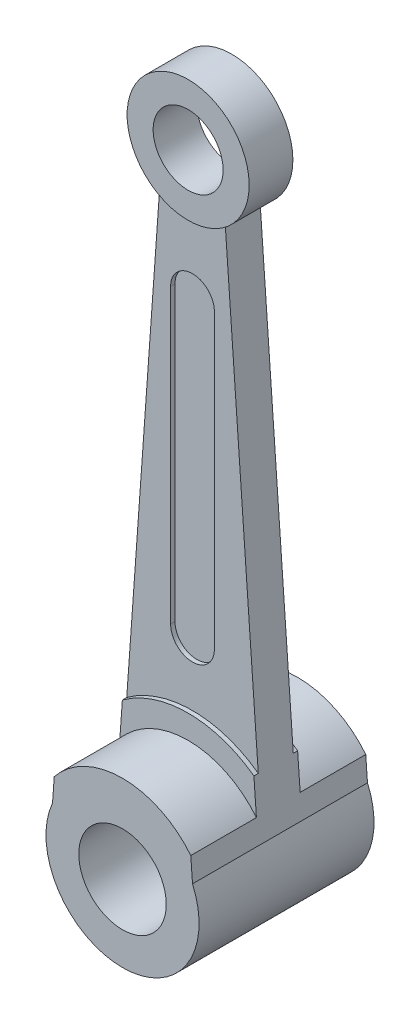
ISO-10303-21;
HEADER;
FILE_DESCRIPTION(('STEP AP214'),'2;1');
FILE_NAME('part.step','',(''),(''),'','','');
FILE_SCHEMA(('AUTOMOTIVE_DESIGN { 1 0 10303 214 1 1 1 1 }'));
ENDSEC;
DATA;
#1=APPLICATION_CONTEXT('core data for automotive mechanical design processes');
#2=APPLICATION_PROTOCOL_DEFINITION('international standard','automotive_design',2000,#1);
#3=PRODUCT_CONTEXT('',#1,'mechanical');
#4=PRODUCT('Part','Part','',(#3));
#5=PRODUCT_RELATED_PRODUCT_CATEGORY('part','',(#4));
#6=PRODUCT_DEFINITION_FORMATION('','',#4);
#7=PRODUCT_DEFINITION_CONTEXT('part definition',#1,'design');
#8=PRODUCT_DEFINITION('design','',#6,#7);
#9=PRODUCT_DEFINITION_SHAPE('','',#8);
#10=(LENGTH_UNIT() NAMED_UNIT(*) SI_UNIT(.MILLI.,.METRE.));
#11=(NAMED_UNIT(*) PLANE_ANGLE_UNIT() SI_UNIT($,.RADIAN.));
#12=(NAMED_UNIT(*) SI_UNIT($,.STERADIAN.) SOLID_ANGLE_UNIT());
#13=UNCERTAINTY_MEASURE_WITH_UNIT(LENGTH_MEASURE(1.E-05),#10,'distance_accuracy_value','');
#14=(GEOMETRIC_REPRESENTATION_CONTEXT(3) GLOBAL_UNCERTAINTY_ASSIGNED_CONTEXT((#13)) GLOBAL_UNIT_ASSIGNED_CONTEXT((#10,
#11,#12)) REPRESENTATION_CONTEXT('',''));
#15=CARTESIAN_POINT('',(0.,0.,0.));
#16=DIRECTION('',(0.,0.,1.));
#17=DIRECTION('',(1.,0.,0.));
#18=AXIS2_PLACEMENT_3D('',#15,#16,#17);
#19=CARTESIAN_POINT('',(1.86324788101989,-1.90582535700159,-0.499999999999999));
#20=DIRECTION('',(0.,0.,1.));
#21=DIRECTION('',(1.,0.,0.));
#22=AXIS2_PLACEMENT_3D('',#19,#20,#21);
#23=CYLINDRICAL_SURFACE('',#22,2.54);
#24=DIRECTION('',(0.,0.,1.));
#25=VECTOR('',#24,1.);
#26=CARTESIAN_POINT('',(3.36688931810119,0.141285394445941,-0.499999999999999));
#27=LINE('',#26,#25);
#28=CARTESIAN_POINT('',(3.36688931810119,0.141285394445941,-0.499999999999999));
#29=VERTEX_POINT('',#28);
#30=CARTESIAN_POINT('',(3.36688931810119,0.141285394445941,-0.399999999999999));
#31=VERTEX_POINT('',#30);
#32=EDGE_CURVE('E370',#29,#31,#27,.T.);
#33=ORIENTED_EDGE('',*,*,#32,.F.);
#34=CARTESIAN_POINT('',(1.86324788101989,-1.90582535700159,-0.499999999999999));
#35=DIRECTION('',(0.,0.,1.));
#36=DIRECTION('',(1.,0.,0.));
#37=AXIS2_PLACEMENT_3D('',#34,#35,#36);
#38=CIRCLE('',#37,2.54);
#39=CARTESIAN_POINT('',(0.359606443938589,0.141285394445941,-0.499999999999999));
#40=VERTEX_POINT('',#39);
#41=EDGE_CURVE('E214',#29,#40,#38,.T.);
#42=ORIENTED_EDGE('',*,*,#41,.T.);
#43=DIRECTION('',(0.,0.,1.));
#44=VECTOR('',#43,1.);
#45=CARTESIAN_POINT('',(0.359606443938589,0.141285394445941,-0.499999999999999));
#46=LINE('',#45,#44);
#47=CARTESIAN_POINT('',(0.359606443938589,0.141285394445941,-0.399999999999999));
#48=VERTEX_POINT('',#47);
#49=EDGE_CURVE('E499',#48,#40,#46,.F.);
#50=ORIENTED_EDGE('',*,*,#49,.F.);
#51=CARTESIAN_POINT('',(1.86324788101989,-1.90582535700159,-0.399999999999999));
#52=DIRECTION('',(0.,0.,1.));
#53=DIRECTION('',(1.,0.,0.));
#54=AXIS2_PLACEMENT_3D('',#51,#52,#53);
#55=CIRCLE('',#54,2.54);
#56=EDGE_CURVE('E249',#31,#48,#55,.T.);
#57=ORIENTED_EDGE('',*,*,#56,.F.);
#58=EDGE_LOOP('',(#33,#42,#50,#57));
#59=FACE_BOUND('',#58,.T.);
#60=ADVANCED_FACE('F50',(#59),#23,.T.);
#61=CARTESIAN_POINT('',(1.86324788101989,2.09417464299841,0.400000000000001));
#62=DIRECTION('',(0.,0.,-1.));
#63=DIRECTION('',(-1.,0.,0.));
#64=AXIS2_PLACEMENT_3D('',#61,#62,#63);
#65=CYLINDRICAL_SURFACE('',#64,0.5);
#66=DIRECTION('',(0.,0.,-1.));
#67=VECTOR('',#66,1.);
#68=CARTESIAN_POINT('',(1.36324788101989,2.09417464299841,0.400000000000001));
#69=LINE('',#68,#67);
#70=CARTESIAN_POINT('',(1.36324788101989,2.09417464299841,-0.299999999999999));
#71=VERTEX_POINT('',#70);
#72=CARTESIAN_POINT('',(1.36324788101989,2.09417464299841,-0.399999999999999));
#73=VERTEX_POINT('',#72);
#74=EDGE_CURVE('E228',#71,#73,#69,.T.);
#75=ORIENTED_EDGE('',*,*,#74,.F.);
#76=CARTESIAN_POINT('',(1.86324788101989,2.09417464299841,-0.299999999999999));
#77=DIRECTION('',(0.,0.,1.));
#78=DIRECTION('',(1.,0.,0.));
#79=AXIS2_PLACEMENT_3D('',#76,#77,#78);
#80=CIRCLE('',#79,0.5);
#81=CARTESIAN_POINT('',(2.36324788101989,2.09417464299841,-0.299999999999999));
#82=VERTEX_POINT('',#81);
#83=EDGE_CURVE('E386',#71,#82,#80,.T.);
#84=ORIENTED_EDGE('',*,*,#83,.T.);
#85=DIRECTION('',(0.,0.,-1.));
#86=VECTOR('',#85,1.);
#87=CARTESIAN_POINT('',(2.36324788101989,2.09417464299841,0.400000000000001));
#88=LINE('',#87,#86);
#89=CARTESIAN_POINT('',(2.36324788101989,2.09417464299841,-0.399999999999999));
#90=VERTEX_POINT('',#89);
#91=EDGE_CURVE('E243',#82,#90,#88,.T.);
#92=ORIENTED_EDGE('',*,*,#91,.T.);
#93=CARTESIAN_POINT('',(1.86324788101989,2.09417464299841,-0.399999999999999));
#94=DIRECTION('',(0.,0.,1.));
#95=DIRECTION('',(1.,0.,0.));
#96=AXIS2_PLACEMENT_3D('',#93,#94,#95);
#97=CIRCLE('',#96,0.5);
#98=EDGE_CURVE('E275',#73,#90,#97,.T.);
#99=ORIENTED_EDGE('',*,*,#98,.F.);
#100=EDGE_LOOP('',(#75,#84,#92,#99));
#101=FACE_BOUND('',#100,.T.);
#102=ADVANCED_FACE('F408',(#101),#65,.F.);
#103=CARTESIAN_POINT('',(1.36324788101989,1.35174813270071,0.400000000000001));
#104=DIRECTION('',(1.,0.,0.));
#105=DIRECTION('',(0.,1.,0.));
#106=AXIS2_PLACEMENT_3D('',#103,#104,#105);
#107=PLANE('',#106);
#108=DIRECTION('',(0.,0.,-1.));
#109=VECTOR('',#108,1.);
#110=CARTESIAN_POINT('',(1.36324788101989,8.78417464299841,0.400000000000001));
#111=LINE('',#110,#109);
#112=CARTESIAN_POINT('',(1.36324788101989,8.78417464299841,-0.299999999999999));
#113=VERTEX_POINT('',#112);
#114=CARTESIAN_POINT('',(1.36324788101989,8.78417464299841,-0.399999999999999));
#115=VERTEX_POINT('',#114);
#116=EDGE_CURVE('E233',#113,#115,#111,.T.);
#117=ORIENTED_EDGE('',*,*,#116,.F.);
#118=DIRECTION('',(0.,-1.,0.));
#119=VECTOR('',#118,1.);
#120=CARTESIAN_POINT('',(1.36324788101989,1.35174813270071,-0.299999999999999));
#121=LINE('',#120,#119);
#122=EDGE_CURVE('E74',#113,#71,#121,.T.);
#123=ORIENTED_EDGE('',*,*,#122,.T.);
#124=ORIENTED_EDGE('',*,*,#74,.T.);
#125=DIRECTION('',(0.,-1.,0.));
#126=VECTOR('',#125,1.);
#127=CARTESIAN_POINT('',(1.36324788101989,1.35174813270071,-0.399999999999999));
#128=LINE('',#127,#126);
#129=EDGE_CURVE('E319',#115,#73,#128,.T.);
#130=ORIENTED_EDGE('',*,*,#129,.F.);
#131=EDGE_LOOP('',(#117,#123,#124,#130));
#132=FACE_BOUND('',#131,.T.);
#133=ADVANCED_FACE('F401',(#132),#107,.T.);
#134=CARTESIAN_POINT('',(1.86324788101989,8.78417464299841,0.400000000000001));
#135=DIRECTION('',(0.,0.,-1.));
#136=DIRECTION('',(-1.,0.,0.));
#137=AXIS2_PLACEMENT_3D('',#134,#135,#136);
#138=CYLINDRICAL_SURFACE('',#137,0.5);
#139=DIRECTION('',(0.,0.,-1.));
#140=VECTOR('',#139,1.);
#141=CARTESIAN_POINT('',(2.36324788101989,8.78417464299841,0.400000000000001));
#142=LINE('',#141,#140);
#143=CARTESIAN_POINT('',(2.36324788101989,8.78417464299841,-0.299999999999999));
#144=VERTEX_POINT('',#143);
#145=CARTESIAN_POINT('',(2.36324788101989,8.78417464299841,-0.399999999999999));
#146=VERTEX_POINT('',#145);
#147=EDGE_CURVE('E238',#144,#146,#142,.T.);
#148=ORIENTED_EDGE('',*,*,#147,.F.);
#149=CARTESIAN_POINT('',(1.86324788101989,8.78417464299841,-0.299999999999999));
#150=DIRECTION('',(0.,0.,1.));
#151=DIRECTION('',(1.,0.,0.));
#152=AXIS2_PLACEMENT_3D('',#149,#150,#151);
#153=CIRCLE('',#152,0.5);
#154=EDGE_CURVE('E342',#144,#113,#153,.T.);
#155=ORIENTED_EDGE('',*,*,#154,.T.);
#156=ORIENTED_EDGE('',*,*,#116,.T.);
#157=CARTESIAN_POINT('',(1.86324788101989,8.78417464299841,-0.399999999999999));
#158=DIRECTION('',(0.,0.,1.));
#159=DIRECTION('',(1.,0.,0.));
#160=AXIS2_PLACEMENT_3D('',#157,#158,#159);
#161=CIRCLE('',#160,0.5);
#162=EDGE_CURVE('E418',#146,#115,#161,.T.);
#163=ORIENTED_EDGE('',*,*,#162,.F.);
#164=EDGE_LOOP('',(#148,#155,#156,#163));
#165=FACE_BOUND('',#164,.T.);
#166=ADVANCED_FACE('F397',(#165),#138,.F.);
#167=CARTESIAN_POINT('',(2.36324788101989,1.35174813270071,0.400000000000001));
#168=DIRECTION('',(1.,0.,0.));
#169=DIRECTION('',(0.,1.,0.));
#170=AXIS2_PLACEMENT_3D('',#167,#168,#169);
#171=PLANE('',#170);
#172=DIRECTION('',(0.,-1.,0.));
#173=VECTOR('',#172,1.);
#174=CARTESIAN_POINT('',(2.36324788101989,1.35174813270071,-0.299999999999999));
#175=LINE('',#174,#173);
#176=EDGE_CURVE('E390',#144,#82,#175,.T.);
#177=ORIENTED_EDGE('',*,*,#176,.F.);
#178=ORIENTED_EDGE('',*,*,#147,.T.);
#179=DIRECTION('',(0.,-1.,0.));
#180=VECTOR('',#179,1.);
#181=CARTESIAN_POINT('',(2.36324788101989,1.35174813270071,-0.399999999999999));
#182=LINE('',#181,#180);
#183=EDGE_CURVE('E259',#146,#90,#182,.T.);
#184=ORIENTED_EDGE('',*,*,#183,.T.);
#185=ORIENTED_EDGE('',*,*,#91,.F.);
#186=EDGE_LOOP('',(#177,#178,#184,#185));
#187=FACE_BOUND('',#186,.T.);
#188=ADVANCED_FACE('F445',(#187),#171,.F.);
#189=CARTESIAN_POINT('',(3.36688931810119,0.141285394445941,0.400000000000001));
#190=VERTEX_POINT('',#189);
#191=CARTESIAN_POINT('',(3.36688931810119,0.141285394445941,0.500000000000001));
#192=VERTEX_POINT('',#191);
#193=EDGE_CURVE('E374',#190,#192,#27,.T.);
#194=ORIENTED_EDGE('',*,*,#193,.F.);
#195=CARTESIAN_POINT('',(1.86324788101989,-1.90582535700159,0.400000000000001));
#196=DIRECTION('',(0.,0.,1.));
#197=DIRECTION('',(1.,0.,0.));
#198=AXIS2_PLACEMENT_3D('',#195,#196,#197);
#199=CIRCLE('',#198,2.54);
#200=CARTESIAN_POINT('',(0.359606443938589,0.141285394445941,0.400000000000001));
#201=VERTEX_POINT('',#200);
#202=EDGE_CURVE('E311',#190,#201,#199,.T.);
#203=ORIENTED_EDGE('',*,*,#202,.T.);
#204=CARTESIAN_POINT('',(0.359606443938589,0.141285394445941,0.500000000000001));
#205=VERTEX_POINT('',#204);
#206=EDGE_CURVE('E361',#205,#201,#46,.F.);
#207=ORIENTED_EDGE('',*,*,#206,.F.);
#208=CARTESIAN_POINT('',(1.86324788101989,-1.90582535700159,0.500000000000001));
#209=DIRECTION('',(0.,0.,1.));
#210=DIRECTION('',(1.,0.,0.));
#211=AXIS2_PLACEMENT_3D('',#208,#209,#210);
#212=CIRCLE('',#211,2.54);
#213=EDGE_CURVE('E215',#192,#205,#212,.T.);
#214=ORIENTED_EDGE('',*,*,#213,.F.);
#215=EDGE_LOOP('',(#194,#203,#207,#214));
#216=FACE_BOUND('',#215,.T.);
#217=ADVANCED_FACE('F456',(#216),#23,.T.);
#218=CARTESIAN_POINT('',(1.6769230929179,1.35174813270071,-0.499999999999999));
#219=DIRECTION('',(0.,0.,1.));
#220=DIRECTION('',(1.,0.,0.));
#221=AXIS2_PLACEMENT_3D('',#218,#219,#220);
#222=PLANE('',#221);
#223=ORIENTED_EDGE('',*,*,#41,.F.);
#224=DIRECTION('',(0.0718181006562888,-0.997417746191696,0.));
#225=VECTOR('',#224,1.);
#226=CARTESIAN_POINT('',(3.27146409205458,1.46656151597349,-0.499999999999999));
#227=LINE('',#226,#225);
#228=CARTESIAN_POINT('',(3.42426347546753,-0.655533265572038,-0.499999999999999));
#229=VERTEX_POINT('',#228);
#230=EDGE_CURVE('E366',#29,#229,#227,.T.);
#231=ORIENTED_EDGE('',*,*,#230,.T.);
#232=CARTESIAN_POINT('',(1.86324788101989,-1.90582535700159,-0.499999999999999));
#233=DIRECTION('',(0.,0.,1.));
#234=DIRECTION('',(1.,0.,0.));
#235=AXIS2_PLACEMENT_3D('',#232,#233,#234);
#236=CIRCLE('',#235,2.);
#237=CARTESIAN_POINT('',(0.302232286572251,-0.655533265572039,-0.499999999999999));
#238=VERTEX_POINT('',#237);
#239=EDGE_CURVE('E334',#229,#238,#236,.T.);
#240=ORIENTED_EDGE('',*,*,#239,.T.);
#241=DIRECTION('',(0.0718181006562885,0.997417746191696,0.));
#242=VECTOR('',#241,1.);
#243=CARTESIAN_POINT('',(0.453109603250883,1.4398676400195,-0.499999999999999));
#244=LINE('',#243,#242);
#245=EDGE_CURVE('E505',#238,#40,#244,.T.);
#246=ORIENTED_EDGE('',*,*,#245,.T.);
#247=EDGE_LOOP('',(#223,#231,#240,#246));
#248=FACE_BOUND('',#247,.T.);
#249=ADVANCED_FACE('F467',(#248),#222,.F.);
#250=CARTESIAN_POINT('',(1.6769230929179,1.35174813270071,0.500000000000001));
#251=DIRECTION('',(0.,0.,1.));
#252=DIRECTION('',(1.,0.,0.));
#253=AXIS2_PLACEMENT_3D('',#250,#251,#252);
#254=PLANE('',#253);
#255=DIRECTION('',(0.0718181006562888,-0.997417746191696,0.));
#256=VECTOR('',#255,1.);
#257=CARTESIAN_POINT('',(3.27146409205458,1.46656151597349,0.500000000000001));
#258=LINE('',#257,#256);
#259=CARTESIAN_POINT('',(3.42426347546753,-0.655533265572038,0.500000000000001));
#260=VERTEX_POINT('',#259);
#261=EDGE_CURVE('E483',#192,#260,#258,.T.);
#262=ORIENTED_EDGE('',*,*,#261,.F.);
#263=ORIENTED_EDGE('',*,*,#213,.T.);
#264=DIRECTION('',(0.0718181006562885,0.997417746191696,0.));
#265=VECTOR('',#264,1.);
#266=CARTESIAN_POINT('',(0.453109603250883,1.4398676400195,0.500000000000001));
#267=LINE('',#266,#265);
#268=CARTESIAN_POINT('',(0.302232286572251,-0.655533265572039,0.500000000000001));
#269=VERTEX_POINT('',#268);
#270=EDGE_CURVE('E362',#269,#205,#267,.T.);
#271=ORIENTED_EDGE('',*,*,#270,.F.);
#272=CARTESIAN_POINT('',(1.86324788101989,-1.90582535700159,0.500000000000001));
#273=DIRECTION('',(0.,0.,1.));
#274=DIRECTION('',(1.,0.,0.));
#275=AXIS2_PLACEMENT_3D('',#272,#273,#274);
#276=CIRCLE('',#275,2.);
#277=EDGE_CURVE('E197',#260,#269,#276,.T.);
#278=ORIENTED_EDGE('',*,*,#277,.F.);
#279=EDGE_LOOP('',(#262,#263,#271,#278));
#280=FACE_BOUND('',#279,.T.);
#281=ADVANCED_FACE('F472',(#280),#254,.T.);
#282=CARTESIAN_POINT('',(1.86324788101989,2.09417464299841,0.300000000000001));
#283=DIRECTION('',(0.,0.,1.));
#284=DIRECTION('',(1.,0.,0.));
#285=AXIS2_PLACEMENT_3D('',#282,#283,#284);
#286=CIRCLE('',#285,0.5);
#287=CARTESIAN_POINT('',(1.36324788101989,2.09417464299841,0.300000000000001));
#288=VERTEX_POINT('',#287);
#289=CARTESIAN_POINT('',(2.36324788101989,2.09417464299841,0.300000000000001));
#290=VERTEX_POINT('',#289);
#291=EDGE_CURVE('E341',#288,#290,#286,.T.);
#292=ORIENTED_EDGE('',*,*,#291,.F.);
#293=CARTESIAN_POINT('',(1.36324788101989,2.09417464299841,0.400000000000001));
#294=VERTEX_POINT('',#293);
#295=EDGE_CURVE('E223',#294,#288,#69,.T.);
#296=ORIENTED_EDGE('',*,*,#295,.F.);
#297=CARTESIAN_POINT('',(1.86324788101989,2.09417464299841,0.400000000000001));
#298=DIRECTION('',(0.,0.,1.));
#299=DIRECTION('',(1.,0.,0.));
#300=AXIS2_PLACEMENT_3D('',#297,#298,#299);
#301=CIRCLE('',#300,0.5);
#302=CARTESIAN_POINT('',(2.36324788101989,2.09417464299841,0.400000000000001));
#303=VERTEX_POINT('',#302);
#304=EDGE_CURVE('E253',#294,#303,#301,.T.);
#305=ORIENTED_EDGE('',*,*,#304,.T.);
#306=EDGE_CURVE('E239',#303,#290,#88,.T.);
#307=ORIENTED_EDGE('',*,*,#306,.T.);
#308=EDGE_LOOP('',(#292,#296,#305,#307));
#309=FACE_BOUND('',#308,.T.);
#310=ADVANCED_FACE('F440',(#309),#65,.F.);
#311=DIRECTION('',(0.,-1.,0.));
#312=VECTOR('',#311,1.);
#313=CARTESIAN_POINT('',(1.36324788101989,1.35174813270071,0.300000000000001));
#314=LINE('',#313,#312);
#315=CARTESIAN_POINT('',(1.36324788101989,8.78417464299841,0.300000000000001));
#316=VERTEX_POINT('',#315);
#317=EDGE_CURVE('E338',#316,#288,#314,.T.);
#318=ORIENTED_EDGE('',*,*,#317,.F.);
#319=CARTESIAN_POINT('',(1.36324788101989,8.78417464299841,0.400000000000001));
#320=VERTEX_POINT('',#319);
#321=EDGE_CURVE('E229',#320,#316,#111,.T.);
#322=ORIENTED_EDGE('',*,*,#321,.F.);
#323=DIRECTION('',(0.,-1.,0.));
#324=VECTOR('',#323,1.);
#325=CARTESIAN_POINT('',(1.36324788101989,1.35174813270071,0.400000000000001));
#326=LINE('',#325,#324);
#327=EDGE_CURVE('E295',#320,#294,#326,.T.);
#328=ORIENTED_EDGE('',*,*,#327,.T.);
#329=ORIENTED_EDGE('',*,*,#295,.T.);
#330=EDGE_LOOP('',(#318,#322,#328,#329));
#331=FACE_BOUND('',#330,.T.);
#332=ADVANCED_FACE('F430',(#331),#107,.T.);
#333=CARTESIAN_POINT('',(1.86324788101989,8.78417464299841,0.300000000000001));
#334=DIRECTION('',(0.,0.,1.));
#335=DIRECTION('',(1.,0.,0.));
#336=AXIS2_PLACEMENT_3D('',#333,#334,#335);
#337=CIRCLE('',#336,0.5);
#338=CARTESIAN_POINT('',(2.36324788101989,8.78417464299841,0.300000000000001));
#339=VERTEX_POINT('',#338);
#340=EDGE_CURVE('E285',#339,#316,#337,.T.);
#341=ORIENTED_EDGE('',*,*,#340,.F.);
#342=CARTESIAN_POINT('',(2.36324788101989,8.78417464299841,0.400000000000001));
#343=VERTEX_POINT('',#342);
#344=EDGE_CURVE('E234',#343,#339,#142,.T.);
#345=ORIENTED_EDGE('',*,*,#344,.F.);
#346=CARTESIAN_POINT('',(1.86324788101989,8.78417464299841,0.400000000000001));
#347=DIRECTION('',(0.,0.,1.));
#348=DIRECTION('',(1.,0.,0.));
#349=AXIS2_PLACEMENT_3D('',#346,#347,#348);
#350=CIRCLE('',#349,0.5);
#351=EDGE_CURVE('E300',#343,#320,#350,.T.);
#352=ORIENTED_EDGE('',*,*,#351,.T.);
#353=ORIENTED_EDGE('',*,*,#321,.T.);
#354=EDGE_LOOP('',(#341,#345,#352,#353));
#355=FACE_BOUND('',#354,.T.);
#356=ADVANCED_FACE('F432',(#355),#138,.F.);
#357=ORIENTED_EDGE('',*,*,#344,.T.);
#358=DIRECTION('',(0.,-1.,0.));
#359=VECTOR('',#358,1.);
#360=CARTESIAN_POINT('',(2.36324788101989,1.35174813270071,0.300000000000001));
#361=LINE('',#360,#359);
#362=EDGE_CURVE('E345',#339,#290,#361,.T.);
#363=ORIENTED_EDGE('',*,*,#362,.T.);
#364=ORIENTED_EDGE('',*,*,#306,.F.);
#365=DIRECTION('',(0.,-1.,0.));
#366=VECTOR('',#365,1.);
#367=CARTESIAN_POINT('',(2.36324788101989,1.35174813270071,0.400000000000001));
#368=LINE('',#367,#366);
#369=EDGE_CURVE('E303',#343,#303,#368,.T.);
#370=ORIENTED_EDGE('',*,*,#369,.F.);
#371=EDGE_LOOP('',(#357,#363,#364,#370));
#372=FACE_BOUND('',#371,.T.);
#373=ADVANCED_FACE('F442',(#372),#171,.F.);
#374=CARTESIAN_POINT('',(1.6769230929179,1.35174813270071,0.400000000000001));
#375=DIRECTION('',(0.,0.,1.));
#376=DIRECTION('',(1.,0.,0.));
#377=AXIS2_PLACEMENT_3D('',#374,#375,#376);
#378=PLANE('',#377);
#379=DIRECTION('',(0.0718181006562888,-0.997417746191696,0.));
#380=VECTOR('',#379,1.);
#381=CARTESIAN_POINT('',(3.27146409205458,1.46656151597349,0.400000000000001));
#382=LINE('',#381,#380);
#383=CARTESIAN_POINT('',(2.61324788101989,10.6079412477915,0.400000000000001));
#384=VERTEX_POINT('',#383);
#385=EDGE_CURVE('E482',#384,#190,#382,.T.);
#386=ORIENTED_EDGE('',*,*,#385,.F.);
#387=CARTESIAN_POINT('',(1.86324788101989,11.7841746429984,0.400000000000001));
#388=DIRECTION('',(0.,0.,1.));
#389=DIRECTION('',(1.,0.,0.));
#390=AXIS2_PLACEMENT_3D('',#387,#388,#389);
#391=CIRCLE('',#390,1.395);
#392=CARTESIAN_POINT('',(1.11324788101989,10.6079412477915,0.400000000000001));
#393=VERTEX_POINT('',#392);
#394=EDGE_CURVE('E307',#393,#384,#391,.T.);
#395=ORIENTED_EDGE('',*,*,#394,.F.);
#396=DIRECTION('',(0.0718181006562885,0.997417746191696,0.));
#397=VECTOR('',#396,1.);
#398=CARTESIAN_POINT('',(0.453109603250883,1.4398676400195,0.400000000000001));
#399=LINE('',#398,#397);
#400=EDGE_CURVE('E355',#201,#393,#399,.T.);
#401=ORIENTED_EDGE('',*,*,#400,.F.);
#402=ORIENTED_EDGE('',*,*,#202,.F.);
#403=EDGE_LOOP('',(#386,#395,#401,#402));
#404=FACE_BOUND('',#403,.T.);
#405=ORIENTED_EDGE('',*,*,#304,.F.);
#406=ORIENTED_EDGE('',*,*,#327,.F.);
#407=ORIENTED_EDGE('',*,*,#351,.F.);
#408=ORIENTED_EDGE('',*,*,#369,.T.);
#409=EDGE_LOOP('',(#405,#406,#407,#408));
#410=FACE_BOUND('',#409,.T.);
#411=ADVANCED_FACE('F437',(#404,#410),#378,.T.);
#412=CARTESIAN_POINT('',(1.6769230929179,1.35174813270071,-0.399999999999999));
#413=DIRECTION('',(0.,0.,1.));
#414=DIRECTION('',(1.,0.,0.));
#415=AXIS2_PLACEMENT_3D('',#412,#413,#414);
#416=PLANE('',#415);
#417=ORIENTED_EDGE('',*,*,#98,.T.);
#418=ORIENTED_EDGE('',*,*,#183,.F.);
#419=ORIENTED_EDGE('',*,*,#162,.T.);
#420=ORIENTED_EDGE('',*,*,#129,.T.);
#421=EDGE_LOOP('',(#417,#418,#419,#420));
#422=FACE_BOUND('',#421,.T.);
#423=CARTESIAN_POINT('',(1.86324788101989,11.7841746429984,-0.399999999999999));
#424=DIRECTION('',(0.,0.,1.));
#425=DIRECTION('',(1.,0.,0.));
#426=AXIS2_PLACEMENT_3D('',#423,#424,#425);
#427=CIRCLE('',#426,1.395);
#428=CARTESIAN_POINT('',(1.11324788101989,10.6079412477915,-0.399999999999999));
#429=VERTEX_POINT('',#428);
#430=CARTESIAN_POINT('',(2.61324788101989,10.6079412477915,-0.399999999999999));
#431=VERTEX_POINT('',#430);
#432=EDGE_CURVE('E254',#429,#431,#427,.T.);
#433=ORIENTED_EDGE('',*,*,#432,.T.);
#434=DIRECTION('',(0.0718181006562888,-0.997417746191696,0.));
#435=VECTOR('',#434,1.);
#436=CARTESIAN_POINT('',(3.27146409205458,1.46656151597349,-0.399999999999999));
#437=LINE('',#436,#435);
#438=EDGE_CURVE('E373',#431,#31,#437,.T.);
#439=ORIENTED_EDGE('',*,*,#438,.T.);
#440=ORIENTED_EDGE('',*,*,#56,.T.);
#441=DIRECTION('',(0.0718181006562885,0.997417746191696,0.));
#442=VECTOR('',#441,1.);
#443=CARTESIAN_POINT('',(0.453109603250883,1.4398676400195,-0.399999999999999));
#444=LINE('',#443,#442);
#445=EDGE_CURVE('E495',#48,#429,#444,.T.);
#446=ORIENTED_EDGE('',*,*,#445,.T.);
#447=EDGE_LOOP('',(#433,#439,#440,#446));
#448=FACE_BOUND('',#447,.T.);
#449=ADVANCED_FACE('F450',(#422,#448),#416,.F.);
#450=CARTESIAN_POINT('',(1.86324788101989,11.7841746429984,-0.499999999999999));
#451=DIRECTION('',(0.,0.,1.));
#452=DIRECTION('',(1.,0.,0.));
#453=AXIS2_PLACEMENT_3D('',#450,#451,#452);
#454=CYLINDRICAL_SURFACE('',#453,0.800000000000001);
#455=CARTESIAN_POINT('',(1.86324788101989,11.7841746429984,-0.499999999999999));
#456=DIRECTION('',(0.,0.,1.));
#457=DIRECTION('',(1.,0.,0.));
#458=AXIS2_PLACEMENT_3D('',#455,#456,#457);
#459=CIRCLE('',#458,0.800000000000001);
#460=CARTESIAN_POINT('',(2.66324788101989,11.7841746429984,-0.499999999999999));
#461=VERTEX_POINT('',#460);
#462=EDGE_CURVE('E276',#461,#461,#459,.T.);
#463=ORIENTED_EDGE('',*,*,#462,.F.);
#464=EDGE_LOOP('',(#463));
#465=FACE_BOUND('',#464,.T.);
#466=CARTESIAN_POINT('',(1.86324788101989,11.7841746429984,0.500000000000001));
#467=DIRECTION('',(0.,0.,1.));
#468=DIRECTION('',(1.,0.,0.));
#469=AXIS2_PLACEMENT_3D('',#466,#467,#468);
#470=CIRCLE('',#469,0.800000000000001);
#471=CARTESIAN_POINT('',(2.66324788101989,11.7841746429984,0.500000000000001));
#472=VERTEX_POINT('',#471);
#473=EDGE_CURVE('E279',#472,#472,#470,.T.);
#474=ORIENTED_EDGE('',*,*,#473,.T.);
#475=EDGE_LOOP('',(#474));
#476=FACE_BOUND('',#475,.T.);
#477=ADVANCED_FACE('F577',(#465,#476),#454,.F.);
#478=CARTESIAN_POINT('',(1.86324788101989,11.7841746429984,-0.499999999999999));
#479=DIRECTION('',(0.,0.,1.));
#480=DIRECTION('',(1.,0.,0.));
#481=AXIS2_PLACEMENT_3D('',#478,#479,#480);
#482=CYLINDRICAL_SURFACE('',#481,1.395);
#483=DIRECTION('',(0.,0.,-1.));
#484=VECTOR('',#483,1.);
#485=CARTESIAN_POINT('',(2.61324788101989,10.6079412477915,0.400000000000001));
#486=LINE('',#485,#484);
#487=EDGE_CURVE('E227',#384,#431,#486,.T.);
#488=ORIENTED_EDGE('',*,*,#487,.T.);
#489=ORIENTED_EDGE('',*,*,#432,.F.);
#490=DIRECTION('',(0.,0.,-1.));
#491=VECTOR('',#490,1.);
#492=CARTESIAN_POINT('',(1.11324788101989,10.6079412477915,0.400000000000001));
#493=LINE('',#492,#491);
#494=EDGE_CURVE('E219',#393,#429,#493,.T.);
#495=ORIENTED_EDGE('',*,*,#494,.F.);
#496=ORIENTED_EDGE('',*,*,#394,.T.);
#497=EDGE_LOOP('',(#488,#489,#495,#496));
#498=FACE_BOUND('',#497,.T.);
#499=CARTESIAN_POINT('',(1.86324788101989,11.7841746429984,0.500000000000001));
#500=DIRECTION('',(0.,0.,1.));
#501=DIRECTION('',(1.,0.,0.));
#502=AXIS2_PLACEMENT_3D('',#499,#500,#501);
#503=CIRCLE('',#502,1.395);
#504=CARTESIAN_POINT('',(3.25824788101989,11.7841746429984,0.500000000000001));
#505=VERTEX_POINT('',#504);
#506=EDGE_CURVE('E284',#505,#505,#503,.T.);
#507=ORIENTED_EDGE('',*,*,#506,.F.);
#508=EDGE_LOOP('',(#507));
#509=FACE_BOUND('',#508,.T.);
#510=CARTESIAN_POINT('',(1.86324788101989,11.7841746429984,-0.499999999999999));
#511=DIRECTION('',(0.,0.,1.));
#512=DIRECTION('',(1.,0.,0.));
#513=AXIS2_PLACEMENT_3D('',#510,#511,#512);
#514=CIRCLE('',#513,1.395);
#515=CARTESIAN_POINT('',(3.25824788101989,11.7841746429984,-0.499999999999999));
#516=VERTEX_POINT('',#515);
#517=EDGE_CURVE('E271',#516,#516,#514,.T.);
#518=ORIENTED_EDGE('',*,*,#517,.T.);
#519=EDGE_LOOP('',(#518));
#520=FACE_BOUND('',#519,.T.);
#521=ADVANCED_FACE('F491',(#498,#509,#520),#482,.T.);
#522=CARTESIAN_POINT('',(1.6769230929179,1.35174813270071,-0.499999999999999));
#523=DIRECTION('',(0.,0.,1.));
#524=DIRECTION('',(1.,0.,0.));
#525=AXIS2_PLACEMENT_3D('',#522,#523,#524);
#526=PLANE('',#525);
#527=ORIENTED_EDGE('',*,*,#462,.T.);
#528=EDGE_LOOP('',(#527));
#529=FACE_BOUND('',#528,.T.);
#530=ORIENTED_EDGE('',*,*,#517,.F.);
#531=EDGE_LOOP('',(#530));
#532=FACE_BOUND('',#531,.T.);
#533=ADVANCED_FACE('F568',(#529,#532),#526,.F.);
#534=CARTESIAN_POINT('',(1.6769230929179,1.35174813270071,0.500000000000001));
#535=DIRECTION('',(0.,0.,1.));
#536=DIRECTION('',(1.,0.,0.));
#537=AXIS2_PLACEMENT_3D('',#534,#535,#536);
#538=PLANE('',#537);
#539=ORIENTED_EDGE('',*,*,#473,.F.);
#540=EDGE_LOOP('',(#539));
#541=FACE_BOUND('',#540,.T.);
#542=ORIENTED_EDGE('',*,*,#506,.T.);
#543=EDGE_LOOP('',(#542));
#544=FACE_BOUND('',#543,.T.);
#545=ADVANCED_FACE('F565',(#541,#544),#538,.T.);
#546=CARTESIAN_POINT('',(1.6769230929179,1.35174813270071,-0.299999999999999));
#547=DIRECTION('',(0.,0.,1.));
#548=DIRECTION('',(1.,0.,0.));
#549=AXIS2_PLACEMENT_3D('',#546,#547,#548);
#550=PLANE('',#549);
#551=ORIENTED_EDGE('',*,*,#122,.F.);
#552=ORIENTED_EDGE('',*,*,#154,.F.);
#553=ORIENTED_EDGE('',*,*,#176,.T.);
#554=ORIENTED_EDGE('',*,*,#83,.F.);
#555=EDGE_LOOP('',(#551,#552,#553,#554));
#556=FACE_BOUND('',#555,.T.);
#557=ADVANCED_FACE('F406',(#556),#550,.F.);
#558=CARTESIAN_POINT('',(1.6769230929179,1.35174813270071,0.300000000000001));
#559=DIRECTION('',(0.,0.,1.));
#560=DIRECTION('',(1.,0.,0.));
#561=AXIS2_PLACEMENT_3D('',#558,#559,#560);
#562=PLANE('',#561);
#563=ORIENTED_EDGE('',*,*,#317,.T.);
#564=ORIENTED_EDGE('',*,*,#291,.T.);
#565=ORIENTED_EDGE('',*,*,#362,.F.);
#566=ORIENTED_EDGE('',*,*,#340,.T.);
#567=EDGE_LOOP('',(#563,#564,#565,#566));
#568=FACE_BOUND('',#567,.T.);
#569=ADVANCED_FACE('F426',(#568),#562,.T.);
#570=CARTESIAN_POINT('',(1.86324788101989,-1.90582535700159,-2.));
#571=DIRECTION('',(0.,0.,1.));
#572=DIRECTION('',(1.,0.,0.));
#573=AXIS2_PLACEMENT_3D('',#570,#571,#572);
#574=CYLINDRICAL_SURFACE('',#573,2.);
#575=DIRECTION('',(0.,0.,1.));
#576=VECTOR('',#575,1.);
#577=CARTESIAN_POINT('',(3.42426347546753,-0.655533265572038,-2.));
#578=LINE('',#577,#576);
#579=CARTESIAN_POINT('',(3.42426347546753,-0.655533265572038,2.));
#580=VERTEX_POINT('',#579);
#581=EDGE_CURVE('E515',#260,#580,#578,.T.);
#582=ORIENTED_EDGE('',*,*,#581,.F.);
#583=ORIENTED_EDGE('',*,*,#277,.T.);
#584=DIRECTION('',(0.,0.,1.));
#585=VECTOR('',#584,1.);
#586=CARTESIAN_POINT('',(0.302232286572251,-0.655533265572039,-2.));
#587=LINE('',#586,#585);
#588=CARTESIAN_POINT('',(0.302232286572251,-0.655533265572039,2.));
#589=VERTEX_POINT('',#588);
#590=EDGE_CURVE('E503',#589,#269,#587,.F.);
#591=ORIENTED_EDGE('',*,*,#590,.F.);
#592=CARTESIAN_POINT('',(1.86324788101989,-1.90582535700159,2.));
#593=DIRECTION('',(0.,0.,1.));
#594=DIRECTION('',(1.,0.,0.));
#595=AXIS2_PLACEMENT_3D('',#592,#593,#594);
#596=CIRCLE('',#595,2.);
#597=EDGE_CURVE('E330',#580,#589,#596,.T.);
#598=ORIENTED_EDGE('',*,*,#597,.F.);
#599=EDGE_LOOP('',(#582,#583,#591,#598));
#600=FACE_BOUND('',#599,.T.);
#601=ADVANCED_FACE('F533',(#600),#574,.T.);
#602=CARTESIAN_POINT('',(1.86324788101989,-1.90582535700159,2.));
#603=DIRECTION('',(0.,0.,1.));
#604=DIRECTION('',(1.,0.,0.));
#605=AXIS2_PLACEMENT_3D('',#602,#603,#604);
#606=PLANE('',#605);
#607=DIRECTION('',(0.0718181006562888,-0.997417746191696,0.));
#608=VECTOR('',#607,1.);
#609=CARTESIAN_POINT('',(3.5057737408446,-1.78755687021975,2.));
#610=LINE('',#609,#608);
#611=CARTESIAN_POINT('',(3.46324788101989,-1.1969530130637,2.));
#612=VERTEX_POINT('',#611);
#613=EDGE_CURVE('E379',#580,#612,#610,.T.);
#614=ORIENTED_EDGE('',*,*,#613,.F.);
#615=ORIENTED_EDGE('',*,*,#597,.T.);
#616=DIRECTION('',(0.0718181006562885,0.997417746191696,0.));
#617=VECTOR('',#616,1.);
#618=CARTESIAN_POINT('',(0.220722021195182,-1.78755687021975,2.));
#619=LINE('',#618,#617);
#620=CARTESIAN_POINT('',(0.263247881019891,-1.1969530130637,2.));
#621=VERTEX_POINT('',#620);
#622=EDGE_CURVE('E498',#621,#589,#619,.T.);
#623=ORIENTED_EDGE('',*,*,#622,.F.);
#624=CARTESIAN_POINT('',(1.86324788101989,-1.90582535700159,2.));
#625=DIRECTION('',(0.,0.,1.));
#626=DIRECTION('',(1.,0.,0.));
#627=AXIS2_PLACEMENT_3D('',#624,#625,#626);
#628=CIRCLE('',#627,1.75);
#629=EDGE_CURVE('E204',#612,#621,#628,.F.);
#630=ORIENTED_EDGE('',*,*,#629,.F.);
#631=EDGE_LOOP('',(#614,#615,#623,#630));
#632=FACE_BOUND('',#631,.T.);
#633=CARTESIAN_POINT('',(1.86324788101989,-1.90582535700159,2.));
#634=DIRECTION('',(0.,0.,1.));
#635=DIRECTION('',(1.,0.,0.));
#636=AXIS2_PLACEMENT_3D('',#633,#634,#635);
#637=CIRCLE('',#636,1.);
#638=CARTESIAN_POINT('',(2.86324788101989,-1.90582535700159,2.));
#639=VERTEX_POINT('',#638);
#640=EDGE_CURVE('E521',#639,#639,#637,.T.);
#641=ORIENTED_EDGE('',*,*,#640,.F.);
#642=EDGE_LOOP('',(#641));
#643=FACE_BOUND('',#642,.T.);
#644=ADVANCED_FACE('F529',(#632,#643),#606,.T.);
#645=DIRECTION('',(0.,0.,1.));
#646=VECTOR('',#645,1.);
#647=CARTESIAN_POINT('',(3.42426347546753,-0.655533265572038,-2.));
#648=LINE('',#647,#646);
#649=CARTESIAN_POINT('',(3.42426347546753,-0.655533265572038,-2.));
#650=VERTEX_POINT('',#649);
#651=EDGE_CURVE('E360',#650,#229,#648,.T.);
#652=ORIENTED_EDGE('',*,*,#651,.F.);
#653=CARTESIAN_POINT('',(1.86324788101989,-1.90582535700159,-2.));
#654=DIRECTION('',(0.,0.,1.));
#655=DIRECTION('',(1.,0.,0.));
#656=AXIS2_PLACEMENT_3D('',#653,#654,#655);
#657=CIRCLE('',#656,2.);
#658=CARTESIAN_POINT('',(0.302232286572251,-0.655533265572039,-2.));
#659=VERTEX_POINT('',#658);
#660=EDGE_CURVE('E329',#650,#659,#657,.T.);
#661=ORIENTED_EDGE('',*,*,#660,.T.);
#662=DIRECTION('',(0.,0.,1.));
#663=VECTOR('',#662,1.);
#664=CARTESIAN_POINT('',(0.302232286572251,-0.655533265572039,-2.));
#665=LINE('',#664,#663);
#666=EDGE_CURVE('E66',#238,#659,#665,.F.);
#667=ORIENTED_EDGE('',*,*,#666,.F.);
#668=ORIENTED_EDGE('',*,*,#239,.F.);
#669=EDGE_LOOP('',(#652,#661,#667,#668));
#670=FACE_BOUND('',#669,.T.);
#671=ADVANCED_FACE('F547',(#670),#574,.T.);
#672=CARTESIAN_POINT('',(1.86324788101989,-1.90582535700159,-2.));
#673=DIRECTION('',(0.,0.,1.));
#674=DIRECTION('',(1.,0.,0.));
#675=AXIS2_PLACEMENT_3D('',#672,#673,#674);
#676=PLANE('',#675);
#677=CARTESIAN_POINT('',(1.86324788101989,-1.90582535700159,-2.));
#678=DIRECTION('',(0.,0.,1.));
#679=DIRECTION('',(1.,0.,0.));
#680=AXIS2_PLACEMENT_3D('',#677,#678,#679);
#681=CIRCLE('',#680,1.);
#682=CARTESIAN_POINT('',(2.86324788101989,-1.90582535700159,-2.));
#683=VERTEX_POINT('',#682);
#684=EDGE_CURVE('E323',#683,#683,#681,.T.);
#685=ORIENTED_EDGE('',*,*,#684,.T.);
#686=EDGE_LOOP('',(#685));
#687=FACE_BOUND('',#686,.T.);
#688=ORIENTED_EDGE('',*,*,#660,.F.);
#689=DIRECTION('',(0.0718181006562888,-0.997417746191696,0.));
#690=VECTOR('',#689,1.);
#691=CARTESIAN_POINT('',(3.5057737408446,-1.78755687021975,-2.));
#692=LINE('',#691,#690);
#693=CARTESIAN_POINT('',(3.46324788101989,-1.1969530130637,-2.));
#694=VERTEX_POINT('',#693);
#695=EDGE_CURVE('E12',#650,#694,#692,.T.);
#696=ORIENTED_EDGE('',*,*,#695,.T.);
#697=CARTESIAN_POINT('',(1.86324788101989,-1.90582535700159,-2.));
#698=DIRECTION('',(0.,0.,1.));
#699=DIRECTION('',(1.,0.,0.));
#700=AXIS2_PLACEMENT_3D('',#697,#698,#699);
#701=CIRCLE('',#700,1.75);
#702=CARTESIAN_POINT('',(0.263247881019891,-1.1969530130637,-2.));
#703=VERTEX_POINT('',#702);
#704=EDGE_CURVE('E59',#694,#703,#701,.F.);
#705=ORIENTED_EDGE('',*,*,#704,.T.);
#706=DIRECTION('',(0.0718181006562885,0.997417746191696,0.));
#707=VECTOR('',#706,1.);
#708=CARTESIAN_POINT('',(0.220722021195182,-1.78755687021975,-2.));
#709=LINE('',#708,#707);
#710=EDGE_CURVE('E187',#703,#659,#709,.T.);
#711=ORIENTED_EDGE('',*,*,#710,.T.);
#712=EDGE_LOOP('',(#688,#696,#705,#711));
#713=FACE_BOUND('',#712,.T.);
#714=ADVANCED_FACE('F208',(#687,#713),#676,.F.);
#715=CARTESIAN_POINT('',(1.86324788101989,-1.90582535700159,-0.499999999999999));
#716=DIRECTION('',(0.,0.,1.));
#717=DIRECTION('',(1.,0.,0.));
#718=AXIS2_PLACEMENT_3D('',#715,#716,#717);
#719=CYLINDRICAL_SURFACE('',#718,1.);
#720=ORIENTED_EDGE('',*,*,#640,.T.);
#721=EDGE_LOOP('',(#720));
#722=FACE_BOUND('',#721,.T.);
#723=ORIENTED_EDGE('',*,*,#684,.F.);
#724=EDGE_LOOP('',(#723));
#725=FACE_BOUND('',#724,.T.);
#726=ADVANCED_FACE('F52',(#722,#725),#719,.F.);
#727=CARTESIAN_POINT('',(1.86324788101989,-1.90582535700159,-2.75));
#728=DIRECTION('',(0.,0.,1.));
#729=DIRECTION('',(1.,0.,0.));
#730=AXIS2_PLACEMENT_3D('',#727,#728,#729);
#731=CYLINDRICAL_SURFACE('',#730,1.75);
#732=ORIENTED_EDGE('',*,*,#629,.T.);
#733=DIRECTION('',(0.,0.,1.));
#734=VECTOR('',#733,1.);
#735=CARTESIAN_POINT('',(0.263247881019891,-1.1969530130637,-2.75));
#736=LINE('',#735,#734);
#737=EDGE_CURVE('E190',#703,#621,#736,.T.);
#738=ORIENTED_EDGE('',*,*,#737,.F.);
#739=ORIENTED_EDGE('',*,*,#704,.F.);
#740=DIRECTION('',(0.,0.,1.));
#741=VECTOR('',#740,1.);
#742=CARTESIAN_POINT('',(3.46324788101989,-1.1969530130637,-2.75));
#743=LINE('',#742,#741);
#744=EDGE_CURVE('E206',#694,#612,#743,.T.);
#745=ORIENTED_EDGE('',*,*,#744,.T.);
#746=EDGE_LOOP('',(#732,#738,#739,#745));
#747=FACE_BOUND('',#746,.T.);
#748=ADVANCED_FACE('F200',(#747),#731,.T.);
#749=CARTESIAN_POINT('',(2.61324788101989,10.6079412477915,-2.75));
#750=DIRECTION('',(-0.997417746191696,-0.0718181006562888,0.));
#751=DIRECTION('',(0.0718181006562888,-0.997417746191696,0.));
#752=AXIS2_PLACEMENT_3D('',#749,#750,#751);
#753=PLANE('',#752);
#754=ORIENTED_EDGE('',*,*,#385,.T.);
#755=ORIENTED_EDGE('',*,*,#193,.T.);
#756=ORIENTED_EDGE('',*,*,#261,.T.);
#757=ORIENTED_EDGE('',*,*,#581,.T.);
#758=ORIENTED_EDGE('',*,*,#613,.T.);
#759=ORIENTED_EDGE('',*,*,#744,.F.);
#760=ORIENTED_EDGE('',*,*,#695,.F.);
#761=ORIENTED_EDGE('',*,*,#651,.T.);
#762=ORIENTED_EDGE('',*,*,#230,.F.);
#763=ORIENTED_EDGE('',*,*,#32,.T.);
#764=ORIENTED_EDGE('',*,*,#438,.F.);
#765=ORIENTED_EDGE('',*,*,#487,.F.);
#766=EDGE_LOOP('',(#754,#755,#756,#757,#758,#759,#760,#761,#762,#763,#764,#765));
#767=FACE_BOUND('',#766,.T.);
#768=ADVANCED_FACE('F536',(#767),#753,.F.);
#769=CARTESIAN_POINT('',(1.11324788101989,10.6079412477915,-2.75));
#770=DIRECTION('',(0.997417746191696,-0.0718181006562885,0.));
#771=DIRECTION('',(0.0718181006562885,0.997417746191696,0.));
#772=AXIS2_PLACEMENT_3D('',#769,#770,#771);
#773=PLANE('',#772);
#774=ORIENTED_EDGE('',*,*,#400,.T.);
#775=ORIENTED_EDGE('',*,*,#494,.T.);
#776=ORIENTED_EDGE('',*,*,#445,.F.);
#777=ORIENTED_EDGE('',*,*,#49,.T.);
#778=ORIENTED_EDGE('',*,*,#245,.F.);
#779=ORIENTED_EDGE('',*,*,#666,.T.);
#780=ORIENTED_EDGE('',*,*,#710,.F.);
#781=ORIENTED_EDGE('',*,*,#737,.T.);
#782=ORIENTED_EDGE('',*,*,#622,.T.);
#783=ORIENTED_EDGE('',*,*,#590,.T.);
#784=ORIENTED_EDGE('',*,*,#270,.T.);
#785=ORIENTED_EDGE('',*,*,#206,.T.);
#786=EDGE_LOOP('',(#774,#775,#776,#777,#778,#779,#780,#781,#782,#783,#784,#785));
#787=FACE_BOUND('',#786,.T.);
#788=ADVANCED_FACE('F189',(#787),#773,.F.);
#789=CLOSED_SHELL('',(#60,#102,#133,#166,#188,#217,#249,#281,#310,#332,#356,#373,#411,#449,#477,
#521,#533,#545,#557,#569,#601,#644,#671,#714,#726,#748,#768,#788));
#790=MANIFOLD_SOLID_BREP('B2',#789);
#791=ADVANCED_BREP_SHAPE_REPRESENTATION('',(#18,#790),#14);
#792=SHAPE_DEFINITION_REPRESENTATION(#9,#791);
ENDSEC;
END-ISO-10303-21;
